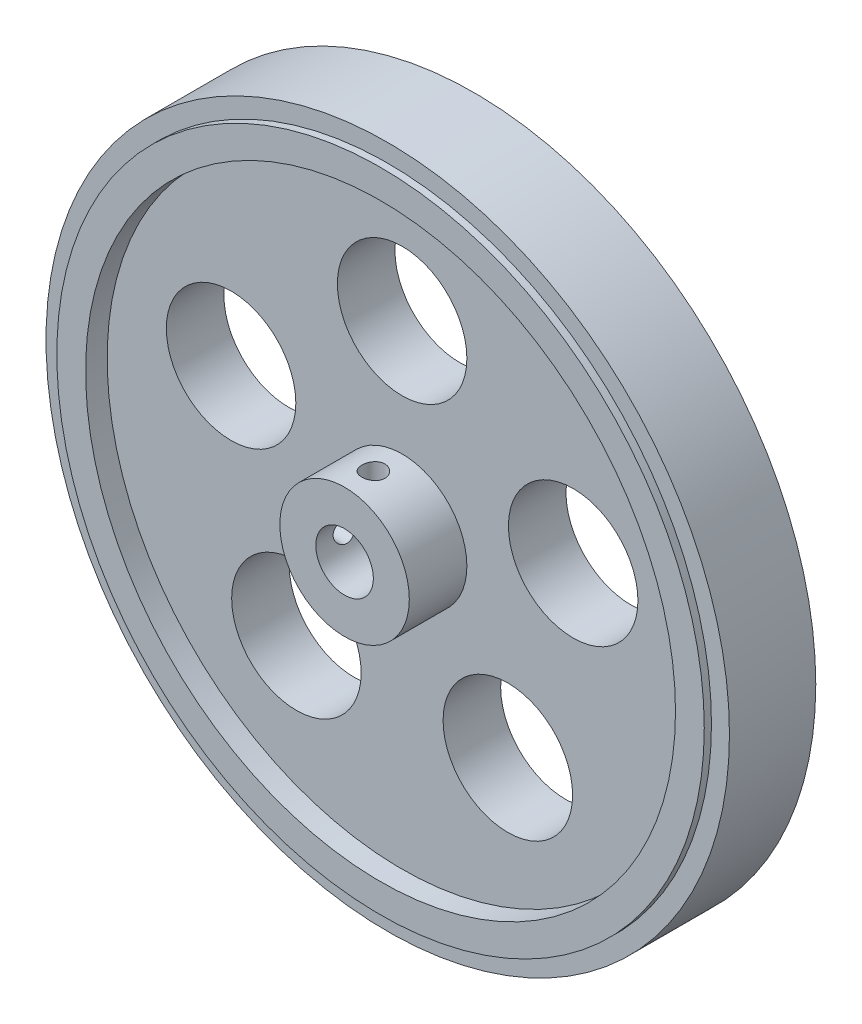
ISO-10303-21;
HEADER;
FILE_DESCRIPTION(('STEP AP214'),'2;1');
FILE_NAME('part.step','',(''),(''),'','','');
FILE_SCHEMA(('AUTOMOTIVE_DESIGN { 1 0 10303 214 1 1 1 1 }'));
ENDSEC;
DATA;
#1=APPLICATION_CONTEXT('core data for automotive mechanical design processes');
#2=APPLICATION_PROTOCOL_DEFINITION('international standard','automotive_design',2000,#1);
#3=PRODUCT_CONTEXT('',#1,'mechanical');
#4=PRODUCT('Part','Part','',(#3));
#5=PRODUCT_RELATED_PRODUCT_CATEGORY('part','',(#4));
#6=PRODUCT_DEFINITION_FORMATION('','',#4);
#7=PRODUCT_DEFINITION_CONTEXT('part definition',#1,'design');
#8=PRODUCT_DEFINITION('design','',#6,#7);
#9=PRODUCT_DEFINITION_SHAPE('','',#8);
#10=(LENGTH_UNIT() NAMED_UNIT(*) SI_UNIT(.MILLI.,.METRE.));
#11=(NAMED_UNIT(*) PLANE_ANGLE_UNIT() SI_UNIT($,.RADIAN.));
#12=(NAMED_UNIT(*) SI_UNIT($,.STERADIAN.) SOLID_ANGLE_UNIT());
#13=UNCERTAINTY_MEASURE_WITH_UNIT(LENGTH_MEASURE(1.E-05),#10,'distance_accuracy_value','');
#14=(GEOMETRIC_REPRESENTATION_CONTEXT(3) GLOBAL_UNCERTAINTY_ASSIGNED_CONTEXT((#13)) GLOBAL_UNIT_ASSIGNED_CONTEXT((#10,
#11,#12)) REPRESENTATION_CONTEXT('',''));
#15=CARTESIAN_POINT('',(0.,0.,0.));
#16=DIRECTION('',(0.,0.,1.));
#17=DIRECTION('',(1.,0.,0.));
#18=AXIS2_PLACEMENT_3D('',#15,#16,#17);
#19=CARTESIAN_POINT('',(0.,0.,-6.));
#20=DIRECTION('',(0.,0.,1.));
#21=DIRECTION('',(1.,0.,0.));
#22=AXIS2_PLACEMENT_3D('',#19,#20,#21);
#23=CYLINDRICAL_SURFACE('',#22,47.5);
#24=CARTESIAN_POINT('',(0.,0.,-6.));
#25=DIRECTION('',(0.,0.,1.));
#26=DIRECTION('',(1.,0.,0.));
#27=AXIS2_PLACEMENT_3D('',#24,#25,#26);
#28=CIRCLE('',#27,47.5);
#29=CARTESIAN_POINT('',(47.5,0.,-6.));
#30=VERTEX_POINT('',#29);
#31=EDGE_CURVE('E42',#30,#30,#28,.T.);
#32=ORIENTED_EDGE('',*,*,#31,.T.);
#33=EDGE_LOOP('',(#32));
#34=FACE_BOUND('',#33,.T.);
#35=CARTESIAN_POINT('',(0.,0.,6.));
#36=DIRECTION('',(0.,0.,1.));
#37=DIRECTION('',(1.,0.,0.));
#38=AXIS2_PLACEMENT_3D('',#35,#36,#37);
#39=CIRCLE('',#38,47.5);
#40=CARTESIAN_POINT('',(47.5,0.,6.));
#41=VERTEX_POINT('',#40);
#42=EDGE_CURVE('E61',#41,#41,#39,.T.);
#43=ORIENTED_EDGE('',*,*,#42,.F.);
#44=EDGE_LOOP('',(#43));
#45=FACE_BOUND('',#44,.T.);
#46=ADVANCED_FACE('F39',(#34,#45),#23,.T.);
#47=CARTESIAN_POINT('',(0.,0.,-6.));
#48=DIRECTION('',(0.,0.,1.));
#49=DIRECTION('',(1.,0.,0.));
#50=AXIS2_PLACEMENT_3D('',#47,#48,#49);
#51=PLANE('',#50);
#52=CARTESIAN_POINT('',(0.,0.,-6.));
#53=DIRECTION('',(0.,0.,-1.));
#54=DIRECTION('',(-1.,0.,0.));
#55=AXIS2_PLACEMENT_3D('',#52,#53,#54);
#56=CIRCLE('',#55,45.);
#57=CARTESIAN_POINT('',(-45.,0.,-6.));
#58=VERTEX_POINT('',#57);
#59=EDGE_CURVE('E10',#58,#58,#56,.T.);
#60=ORIENTED_EDGE('',*,*,#59,.F.);
#61=EDGE_LOOP('',(#60));
#62=FACE_BOUND('',#61,.T.);
#63=ORIENTED_EDGE('',*,*,#31,.F.);
#64=EDGE_LOOP('',(#63));
#65=FACE_BOUND('',#64,.T.);
#66=ADVANCED_FACE('F72',(#62,#65),#51,.F.);
#67=CARTESIAN_POINT('',(0.,0.,6.));
#68=DIRECTION('',(0.,0.,1.));
#69=DIRECTION('',(1.,0.,0.));
#70=AXIS2_PLACEMENT_3D('',#67,#68,#69);
#71=PLANE('',#70);
#72=CARTESIAN_POINT('',(0.,0.,6.));
#73=DIRECTION('',(0.,0.,1.));
#74=DIRECTION('',(1.,0.,0.));
#75=AXIS2_PLACEMENT_3D('',#72,#73,#74);
#76=CIRCLE('',#75,45.);
#77=CARTESIAN_POINT('',(45.,0.,6.));
#78=VERTEX_POINT('',#77);
#79=EDGE_CURVE('E47',#78,#78,#76,.T.);
#80=ORIENTED_EDGE('',*,*,#79,.F.);
#81=EDGE_LOOP('',(#80));
#82=FACE_BOUND('',#81,.T.);
#83=ORIENTED_EDGE('',*,*,#42,.T.);
#84=EDGE_LOOP('',(#83));
#85=FACE_BOUND('',#84,.T.);
#86=ADVANCED_FACE('F74',(#82,#85),#71,.T.);
#87=CARTESIAN_POINT('',(0.,0.,7.));
#88=DIRECTION('',(0.,0.,-1.));
#89=DIRECTION('',(-1.,0.,0.));
#90=AXIS2_PLACEMENT_3D('',#87,#88,#89);
#91=CYLINDRICAL_SURFACE('',#90,45.);
#92=CARTESIAN_POINT('',(0.,0.,7.));
#93=DIRECTION('',(0.,0.,1.));
#94=DIRECTION('',(1.,0.,0.));
#95=AXIS2_PLACEMENT_3D('',#92,#93,#94);
#96=CIRCLE('',#95,45.);
#97=CARTESIAN_POINT('',(45.,0.,7.));
#98=VERTEX_POINT('',#97);
#99=EDGE_CURVE('E58',#98,#98,#96,.T.);
#100=ORIENTED_EDGE('',*,*,#99,.F.);
#101=EDGE_LOOP('',(#100));
#102=FACE_BOUND('',#101,.T.);
#103=ORIENTED_EDGE('',*,*,#79,.T.);
#104=EDGE_LOOP('',(#103));
#105=FACE_BOUND('',#104,.T.);
#106=ADVANCED_FACE('F80',(#102,#105),#91,.T.);
#107=CARTESIAN_POINT('',(0.,0.,7.));
#108=DIRECTION('',(0.,0.,1.));
#109=DIRECTION('',(1.,0.,0.));
#110=AXIS2_PLACEMENT_3D('',#107,#108,#109);
#111=PLANE('',#110);
#112=CARTESIAN_POINT('',(0.,0.,7.));
#113=DIRECTION('',(0.,0.,1.));
#114=DIRECTION('',(1.,0.,0.));
#115=AXIS2_PLACEMENT_3D('',#112,#113,#114);
#116=CIRCLE('',#115,41.);
#117=CARTESIAN_POINT('',(41.,0.,7.));
#118=VERTEX_POINT('',#117);
#119=EDGE_CURVE('E217',#118,#118,#116,.T.);
#120=ORIENTED_EDGE('',*,*,#119,.F.);
#121=EDGE_LOOP('',(#120));
#122=FACE_BOUND('',#121,.T.);
#123=ORIENTED_EDGE('',*,*,#99,.T.);
#124=EDGE_LOOP('',(#123));
#125=FACE_BOUND('',#124,.T.);
#126=ADVANCED_FACE('F86',(#122,#125),#111,.T.);
#127=CARTESIAN_POINT('',(0.,0.,-7.));
#128=DIRECTION('',(0.,0.,1.));
#129=DIRECTION('',(1.,0.,0.));
#130=AXIS2_PLACEMENT_3D('',#127,#128,#129);
#131=CYLINDRICAL_SURFACE('',#130,45.);
#132=CARTESIAN_POINT('',(0.,0.,-7.));
#133=DIRECTION('',(0.,0.,-1.));
#134=DIRECTION('',(-1.,0.,0.));
#135=AXIS2_PLACEMENT_3D('',#132,#133,#134);
#136=CIRCLE('',#135,45.);
#137=CARTESIAN_POINT('',(-45.,0.,-7.));
#138=VERTEX_POINT('',#137);
#139=EDGE_CURVE('E56',#138,#138,#136,.T.);
#140=ORIENTED_EDGE('',*,*,#139,.F.);
#141=EDGE_LOOP('',(#140));
#142=FACE_BOUND('',#141,.T.);
#143=ORIENTED_EDGE('',*,*,#59,.T.);
#144=EDGE_LOOP('',(#143));
#145=FACE_BOUND('',#144,.T.);
#146=ADVANCED_FACE('F90',(#142,#145),#131,.T.);
#147=CARTESIAN_POINT('',(0.,0.,-7.));
#148=DIRECTION('',(0.,0.,-1.));
#149=DIRECTION('',(-1.,0.,0.));
#150=AXIS2_PLACEMENT_3D('',#147,#148,#149);
#151=PLANE('',#150);
#152=CARTESIAN_POINT('',(0.,0.,-7.));
#153=DIRECTION('',(0.,0.,-1.));
#154=DIRECTION('',(-1.,0.,0.));
#155=AXIS2_PLACEMENT_3D('',#152,#153,#154);
#156=CIRCLE('',#155,41.);
#157=CARTESIAN_POINT('',(-41.,0.,-7.));
#158=VERTEX_POINT('',#157);
#159=EDGE_CURVE('E226',#158,#158,#156,.T.);
#160=ORIENTED_EDGE('',*,*,#159,.F.);
#161=EDGE_LOOP('',(#160));
#162=FACE_BOUND('',#161,.T.);
#163=ORIENTED_EDGE('',*,*,#139,.T.);
#164=EDGE_LOOP('',(#163));
#165=FACE_BOUND('',#164,.T.);
#166=ADVANCED_FACE('F94',(#162,#165),#151,.T.);
#167=CARTESIAN_POINT('',(0.,0.,4.));
#168=DIRECTION('',(0.,0.,1.));
#169=DIRECTION('',(1.,0.,0.));
#170=AXIS2_PLACEMENT_3D('',#167,#168,#169);
#171=CYLINDRICAL_SURFACE('',#170,41.);
#172=CARTESIAN_POINT('',(0.,0.,4.));
#173=DIRECTION('',(0.,0.,1.));
#174=DIRECTION('',(1.,0.,0.));
#175=AXIS2_PLACEMENT_3D('',#172,#173,#174);
#176=CIRCLE('',#175,41.);
#177=CARTESIAN_POINT('',(41.,0.,4.));
#178=VERTEX_POINT('',#177);
#179=EDGE_CURVE('E223',#178,#178,#176,.T.);
#180=ORIENTED_EDGE('',*,*,#179,.F.);
#181=EDGE_LOOP('',(#180));
#182=FACE_BOUND('',#181,.T.);
#183=ORIENTED_EDGE('',*,*,#119,.T.);
#184=EDGE_LOOP('',(#183));
#185=FACE_BOUND('',#184,.T.);
#186=ADVANCED_FACE('F98',(#182,#185),#171,.F.);
#187=CARTESIAN_POINT('',(0.,0.,4.));
#188=DIRECTION('',(0.,0.,1.));
#189=DIRECTION('',(1.,0.,0.));
#190=AXIS2_PLACEMENT_3D('',#187,#188,#189);
#191=PLANE('',#190);
#192=CARTESIAN_POINT('',(23.7764129073788,7.72542485937368,4.));
#193=DIRECTION('',(0.,0.,1.));
#194=DIRECTION('',(1.,0.,0.));
#195=AXIS2_PLACEMENT_3D('',#192,#193,#194);
#196=CIRCLE('',#195,9.00000000000004);
#197=CARTESIAN_POINT('',(32.7764129073789,7.72542485937368,4.));
#198=VERTEX_POINT('',#197);
#199=EDGE_CURVE('E249',#198,#198,#196,.T.);
#200=ORIENTED_EDGE('',*,*,#199,.F.);
#201=EDGE_LOOP('',(#200));
#202=FACE_BOUND('',#201,.T.);
#203=CARTESIAN_POINT('',(14.6946313073118,-20.2254248593737,4.));
#204=DIRECTION('',(0.,0.,1.));
#205=DIRECTION('',(1.,0.,0.));
#206=AXIS2_PLACEMENT_3D('',#203,#204,#205);
#207=CIRCLE('',#206,9.00000000000009);
#208=CARTESIAN_POINT('',(23.6946313073119,-20.2254248593737,4.));
#209=VERTEX_POINT('',#208);
#210=EDGE_CURVE('E255',#209,#209,#207,.T.);
#211=ORIENTED_EDGE('',*,*,#210,.F.);
#212=EDGE_LOOP('',(#211));
#213=FACE_BOUND('',#212,.T.);
#214=CARTESIAN_POINT('',(-14.6946313073118,-20.2254248593737,4.));
#215=DIRECTION('',(0.,0.,1.));
#216=DIRECTION('',(1.,0.,0.));
#217=AXIS2_PLACEMENT_3D('',#214,#215,#216);
#218=CIRCLE('',#217,9.00000000000008);
#219=CARTESIAN_POINT('',(-5.69463130731175,-20.2254248593737,4.));
#220=VERTEX_POINT('',#219);
#221=EDGE_CURVE('E261',#220,#220,#218,.T.);
#222=ORIENTED_EDGE('',*,*,#221,.F.);
#223=EDGE_LOOP('',(#222));
#224=FACE_BOUND('',#223,.T.);
#225=CARTESIAN_POINT('',(-23.7764129073788,7.72542485937369,4.));
#226=DIRECTION('',(0.,0.,1.));
#227=DIRECTION('',(1.,0.,0.));
#228=AXIS2_PLACEMENT_3D('',#225,#226,#227);
#229=CIRCLE('',#228,9.00000000000001);
#230=CARTESIAN_POINT('',(-14.7764129073788,7.72542485937369,4.));
#231=VERTEX_POINT('',#230);
#232=EDGE_CURVE('E265',#231,#231,#229,.T.);
#233=ORIENTED_EDGE('',*,*,#232,.F.);
#234=EDGE_LOOP('',(#233));
#235=FACE_BOUND('',#234,.T.);
#236=CARTESIAN_POINT('',(0.,25.,4.));
#237=DIRECTION('',(0.,0.,1.));
#238=DIRECTION('',(1.,0.,0.));
#239=AXIS2_PLACEMENT_3D('',#236,#237,#238);
#240=CIRCLE('',#239,8.99999999999998);
#241=CARTESIAN_POINT('',(8.99999999999998,25.,4.));
#242=VERTEX_POINT('',#241);
#243=EDGE_CURVE('E269',#242,#242,#240,.T.);
#244=ORIENTED_EDGE('',*,*,#243,.F.);
#245=EDGE_LOOP('',(#244));
#246=FACE_BOUND('',#245,.T.);
#247=CARTESIAN_POINT('',(0.,0.,4.));
#248=DIRECTION('',(0.,0.,1.));
#249=DIRECTION('',(1.,0.,0.));
#250=AXIS2_PLACEMENT_3D('',#247,#248,#249);
#251=CIRCLE('',#250,9.);
#252=CARTESIAN_POINT('',(9.,0.,4.));
#253=VERTEX_POINT('',#252);
#254=EDGE_CURVE('E214',#253,#253,#251,.T.);
#255=ORIENTED_EDGE('',*,*,#254,.F.);
#256=EDGE_LOOP('',(#255));
#257=FACE_BOUND('',#256,.T.);
#258=ORIENTED_EDGE('',*,*,#179,.T.);
#259=EDGE_LOOP('',(#258));
#260=FACE_BOUND('',#259,.T.);
#261=ADVANCED_FACE('F118',(#202,#213,#224,#235,#246,#257,#260),#191,.T.);
#262=CARTESIAN_POINT('',(0.,0.,12.));
#263=DIRECTION('',(0.,0.,1.));
#264=DIRECTION('',(1.,0.,0.));
#265=AXIS2_PLACEMENT_3D('',#262,#263,#264);
#266=PLANE('',#265);
#267=CARTESIAN_POINT('',(0.,0.,12.));
#268=DIRECTION('',(0.,0.,1.));
#269=DIRECTION('',(1.,0.,0.));
#270=AXIS2_PLACEMENT_3D('',#267,#268,#269);
#271=CIRCLE('',#270,4.);
#272=CARTESIAN_POINT('',(4.,0.,12.));
#273=VERTEX_POINT('',#272);
#274=EDGE_CURVE('E294',#273,#273,#271,.T.);
#275=ORIENTED_EDGE('',*,*,#274,.F.);
#276=EDGE_LOOP('',(#275));
#277=FACE_BOUND('',#276,.T.);
#278=CARTESIAN_POINT('',(0.,0.,12.));
#279=DIRECTION('',(0.,0.,1.));
#280=DIRECTION('',(1.,0.,0.));
#281=AXIS2_PLACEMENT_3D('',#278,#279,#280);
#282=CIRCLE('',#281,9.);
#283=CARTESIAN_POINT('',(9.,0.,12.));
#284=VERTEX_POINT('',#283);
#285=EDGE_CURVE('E211',#284,#284,#282,.T.);
#286=ORIENTED_EDGE('',*,*,#285,.T.);
#287=EDGE_LOOP('',(#286));
#288=FACE_BOUND('',#287,.T.);
#289=ADVANCED_FACE('F114',(#277,#288),#266,.T.);
#290=CARTESIAN_POINT('',(0.,0.,12.));
#291=DIRECTION('',(0.,0.,-1.));
#292=DIRECTION('',(-1.,0.,0.));
#293=AXIS2_PLACEMENT_3D('',#290,#291,#292);
#294=CYLINDRICAL_SURFACE('',#293,9.);
#295=CARTESIAN_POINT('',(0.,9.,9.6));
#296=CARTESIAN_POINT('',(0.0891199889022123,8.99999842101241,9.59999650999753));
#297=CARTESIAN_POINT('',(0.178286373811932,8.99866254538546,9.59252886703613));
#298=CARTESIAN_POINT('',(0.354112162977067,8.99346217162353,9.56287155401015));
#299=CARTESIAN_POINT('',(0.440769290112072,8.98959544750788,9.540668923705));
#300=CARTESIAN_POINT('',(0.609007816682141,8.97976647847911,9.48223829206875));
#301=CARTESIAN_POINT('',(0.690593523221338,8.97380604116375,9.44602238630523));
#302=CARTESIAN_POINT('',(0.846521639833109,8.9604426739079,9.36062632259557));
#303=CARTESIAN_POINT('',(0.920864750907525,8.95303988377943,9.31144742103254));
#304=CARTESIAN_POINT('',(1.06101042913895,8.93752107386243,9.20095610959205));
#305=CARTESIAN_POINT('',(1.12672329975455,8.92939884036114,9.13953079061428));
#306=CARTESIAN_POINT('',(1.24696773358254,8.91340337467269,9.0065332527793));
#307=CARTESIAN_POINT('',(1.30149854179097,8.90553015932936,8.9349603493167));
#308=CARTESIAN_POINT('',(1.39819750156619,8.89086390002565,8.78307389304275));
#309=CARTESIAN_POINT('',(1.44027562556876,8.88407887715324,8.7027021815132));
#310=CARTESIAN_POINT('',(1.51029875147196,8.87244417371761,8.53589010241383));
#311=CARTESIAN_POINT('',(1.53824484413461,8.86759434379518,8.44945020379562));
#312=CARTESIAN_POINT('',(1.57892525274373,8.86044137771626,8.27391103529108));
#313=CARTESIAN_POINT('',(1.59181525903408,8.85811219515826,8.18484892785442));
#314=CARTESIAN_POINT('',(1.60250059457246,8.85618559649113,8.0057979383732));
#315=CARTESIAN_POINT('',(1.60029713955403,8.85658796036402,7.91580913155451));
#316=CARTESIAN_POINT('',(1.5809846181553,8.86005524545088,7.73857914392946));
#317=CARTESIAN_POINT('',(1.56405155315557,8.86308872669843,7.65131807918593));
#318=CARTESIAN_POINT('',(1.51603718898619,8.87142714923806,7.48089546055713));
#319=CARTESIAN_POINT('',(1.48495534402251,8.87673217815541,7.39773406495518));
#320=CARTESIAN_POINT('',(1.40935057289568,8.88904934759434,7.23735073761909));
#321=CARTESIAN_POINT('',(1.36475561236361,8.89607059700136,7.1601634912911));
#322=CARTESIAN_POINT('',(1.26344153576323,8.91102292647752,7.01430103908486));
#323=CARTESIAN_POINT('',(1.2067213099282,8.91895408979587,6.94562661325334));
#324=CARTESIAN_POINT('',(1.08181303730033,8.93497015847767,6.81772140413576));
#325=CARTESIAN_POINT('',(1.01347422269308,8.94305565233282,6.75863783095746));
#326=CARTESIAN_POINT('',(0.867775747328104,8.95836603849457,6.65275278362007));
#327=CARTESIAN_POINT('',(0.790416012610209,8.96559092374428,6.60595141016978));
#328=CARTESIAN_POINT('',(0.628725387252163,8.97837847205809,6.52594160196901));
#329=CARTESIAN_POINT('',(0.544387323694019,8.9839393969741,6.4927473677391));
#330=CARTESIAN_POINT('',(0.371211899336645,8.99275880001199,6.44103703919972));
#331=CARTESIAN_POINT('',(0.28237496838026,8.9960174976563,6.42251954541019));
#332=CARTESIAN_POINT('',(0.103991168574758,8.99983543164877,6.40089067226623));
#333=CARTESIAN_POINT('',(0.014469509682857,9.00043003979579,6.39757740804007));
#334=CARTESIAN_POINT('',(-0.163849121698735,8.99895010874175,6.40591109791396));
#335=CARTESIAN_POINT('',(-0.252646125889518,8.9968756869381,6.41755739401701));
#336=CARTESIAN_POINT('',(-0.426362531500534,8.99031274069892,6.45531171482474));
#337=CARTESIAN_POINT('',(-0.511304597461475,8.98584109846802,6.48131864407655));
#338=CARTESIAN_POINT('',(-0.675623007789177,8.97498301575709,6.54694737387567));
#339=CARTESIAN_POINT('',(-0.754999004457336,8.96859645578812,6.5865700240528));
#340=CARTESIAN_POINT('',(-0.90680107105383,8.95452886378439,6.67875974307018));
#341=CARTESIAN_POINT('',(-0.97915026454899,8.94683560234911,6.73145149546752));
#342=CARTESIAN_POINT('',(-1.11405184565034,8.93104192631922,6.84811364152417));
#343=CARTESIAN_POINT('',(-1.17660341600601,8.9229414778342,6.9120849751037));
#344=CARTESIAN_POINT('',(-1.29089228646818,8.9071304689102,7.05040034951394));
#345=CARTESIAN_POINT('',(-1.34249245590756,8.89942567549632,7.12485846643002));
#346=CARTESIAN_POINT('',(-1.4324527450687,8.88539029596841,7.28150445705407));
#347=CARTESIAN_POINT('',(-1.47081332418193,8.87905966217619,7.36369206243588));
#348=CARTESIAN_POINT('',(-1.53300592917691,8.8685336915973,7.53309895021014));
#349=CARTESIAN_POINT('',(-1.55690340007955,8.86432875059592,7.6202935822484));
#350=CARTESIAN_POINT('',(-1.5896953542958,8.85850726118019,7.79754125276742));
#351=CARTESIAN_POINT('',(-1.59859134138627,8.85689045332734,7.88759400382285));
#352=CARTESIAN_POINT('',(-1.60108148470831,8.85644051064373,8.0666301769728));
#353=CARTESIAN_POINT('',(-1.59489171371261,8.85756806805314,8.15561056775652));
#354=CARTESIAN_POINT('',(-1.56785629660067,8.86239313508238,8.33124158974503));
#355=CARTESIAN_POINT('',(-1.54701071784785,8.86609063288983,8.4178922316563));
#356=CARTESIAN_POINT('',(-1.4913426083545,8.87562318192817,8.58630350608332));
#357=CARTESIAN_POINT('',(-1.45654117989918,8.88145500474261,8.66807130831137));
#358=CARTESIAN_POINT('',(-1.37397214829578,8.89460176575639,8.82464242816941));
#359=CARTESIAN_POINT('',(-1.32620375866526,8.90191679390947,8.89944532298858));
#360=CARTESIAN_POINT('',(-1.21829594749923,8.91732902502244,9.04105014594484));
#361=CARTESIAN_POINT('',(-1.1579984307139,8.92543544320789,9.10773061615621));
#362=CARTESIAN_POINT('',(-1.02707564037896,8.94144596625312,9.23009985331686));
#363=CARTESIAN_POINT('',(-0.956447994090279,8.94935002414111,9.28578608806405));
#364=CARTESIAN_POINT('',(-0.806197276783407,8.96413880199544,9.38499697811787));
#365=CARTESIAN_POINT('',(-0.726506966982223,8.97101489116936,9.42842111602936));
#366=CARTESIAN_POINT('',(-0.560868965742403,8.98288895349221,9.50119715800776));
#367=CARTESIAN_POINT('',(-0.474927416325986,8.98788874118243,9.53056266557114));
#368=CARTESIAN_POINT('',(-0.323910705887374,8.99439282129417,9.5682264303516));
#369=CARTESIAN_POINT('',(-0.259733829734236,8.99648394692915,9.58012177954452));
#370=CARTESIAN_POINT('',(-0.130379566355957,8.9992880992576,9.59600975712086));
#371=CARTESIAN_POINT('',(-0.0652022004121546,9.00000115522305,9.60000255336478));
#372=CARTESIAN_POINT('',(0.,9.,9.6));
#373=B_SPLINE_CURVE_WITH_KNOTS('',3,(#295,#296,#297,#298,#299,#300,#301,#302,#303,#304,#305,
#306,#307,#308,#309,#310,#311,#312,#313,#314,#315,#316,#317,#318,#319,#320,#321,#322,#323,#324,
#325,#326,#327,#328,#329,#330,#331,#332,#333,#334,#335,#336,#337,#338,#339,#340,#341,#342,#343,
#344,#345,#346,#347,#348,#349,#350,#351,#352,#353,#354,#355,#356,#357,#358,#359,#360,#361,#362,
#363,#364,#365,#366,#367,#368,#369,#370,#371,#372),.UNSPECIFIED.,.T.,.F.,(4,2,2,2,2,2,2,2,2,2,2,
2,2,2,2,2,2,2,2,2,2,2,2,2,2,2,2,2,2,2,2,2,2,2,2,2,2,2,4),(0.,0.26712157461523,0.534478409438381,
0.801604987979056,1.06870568592856,1.33839346950073,1.60809945618666,1.87971016674491,
2.15129991019101,2.42005564284313,2.68878972827276,2.95435619462343,3.21993290615981,
3.48695100494025,3.75399355306365,4.02481082247453,4.29563031240196,4.5667317165881,
4.8378072671677,5.10527280313427,5.37272657501887,5.63832110619031,5.90393221364347,
6.17218198568697,6.44045412138395,6.71190959939084,6.98335565740308,7.25356406549827,
7.52374538578562,7.7900797081413,8.05641280633542,8.32234469843295,8.58829272364878,
8.85782605825659,9.12742139978661,9.39916649807141,9.67064811458915,9.86608445414369,
10.0615166423319),.UNSPECIFIED.);
#374=CARTESIAN_POINT('',(0.,9.,9.6));
#375=VERTEX_POINT('',#374);
#376=EDGE_CURVE('E178',#375,#375,#373,.T.);
#377=ORIENTED_EDGE('',*,*,#376,.F.);
#378=EDGE_LOOP('',(#377));
#379=FACE_BOUND('',#378,.T.);
#380=CARTESIAN_POINT('',(-9.,0.,9.6));
#381=CARTESIAN_POINT('',(-8.99999842101241,0.0891199889022124,9.59999650999753));
#382=CARTESIAN_POINT('',(-8.99866254538546,0.178286373811932,9.59252886703613));
#383=CARTESIAN_POINT('',(-8.99346217162353,0.354112162977067,9.56287155401015));
#384=CARTESIAN_POINT('',(-8.98959544750788,0.440769290112072,9.54066892370501));
#385=CARTESIAN_POINT('',(-8.97976647847911,0.609007816682141,9.48223829206875));
#386=CARTESIAN_POINT('',(-8.97380604116375,0.690593523221337,9.44602238630523));
#387=CARTESIAN_POINT('',(-8.9604426739079,0.846521639833109,9.36062632259557));
#388=CARTESIAN_POINT('',(-8.95303988377943,0.920864750907525,9.31144742103254));
#389=CARTESIAN_POINT('',(-8.93752107386243,1.06101042913895,9.20095610959205));
#390=CARTESIAN_POINT('',(-8.92939884036114,1.12672329975455,9.13953079061428));
#391=CARTESIAN_POINT('',(-8.91340337467269,1.24696773358254,9.0065332527793));
#392=CARTESIAN_POINT('',(-8.90553015932936,1.30149854179097,8.9349603493167));
#393=CARTESIAN_POINT('',(-8.89086390002565,1.39819750156619,8.78307389304275));
#394=CARTESIAN_POINT('',(-8.88407887715324,1.44027562556877,8.7027021815132));
#395=CARTESIAN_POINT('',(-8.87244417371761,1.51029875147196,8.53589010241383));
#396=CARTESIAN_POINT('',(-8.86759434379518,1.53824484413461,8.44945020379562));
#397=CARTESIAN_POINT('',(-8.86044137771626,1.57892525274373,8.27391103529108));
#398=CARTESIAN_POINT('',(-8.85811219515826,1.59181525903408,8.18484892785442));
#399=CARTESIAN_POINT('',(-8.85618559649113,1.60250059457246,8.0057979383732));
#400=CARTESIAN_POINT('',(-8.85658796036402,1.60029713955403,7.91580913155451));
#401=CARTESIAN_POINT('',(-8.86005524545088,1.5809846181553,7.73857914392947));
#402=CARTESIAN_POINT('',(-8.86308872669843,1.56405155315557,7.65131807918593));
#403=CARTESIAN_POINT('',(-8.87142714923806,1.51603718898619,7.48089546055713));
#404=CARTESIAN_POINT('',(-8.87673217815541,1.48495534402251,7.39773406495518));
#405=CARTESIAN_POINT('',(-8.88904934759434,1.40935057289568,7.23735073761909));
#406=CARTESIAN_POINT('',(-8.89607059700136,1.36475561236361,7.1601634912911));
#407=CARTESIAN_POINT('',(-8.91102292647752,1.26344153576323,7.01430103908486));
#408=CARTESIAN_POINT('',(-8.91895408979587,1.2067213099282,6.94562661325334));
#409=CARTESIAN_POINT('',(-8.93497015847767,1.08181303730034,6.81772140413576));
#410=CARTESIAN_POINT('',(-8.94305565233282,1.01347422269308,6.75863783095746));
#411=CARTESIAN_POINT('',(-8.95836603849457,0.867775747328105,6.65275278362007));
#412=CARTESIAN_POINT('',(-8.96559092374428,0.79041601261021,6.60595141016978));
#413=CARTESIAN_POINT('',(-8.97837847205809,0.628725387252162,6.52594160196901));
#414=CARTESIAN_POINT('',(-8.9839393969741,0.544387323694019,6.4927473677391));
#415=CARTESIAN_POINT('',(-8.99275880001199,0.371211899336645,6.44103703919972));
#416=CARTESIAN_POINT('',(-8.9960174976563,0.28237496838026,6.42251954541019));
#417=CARTESIAN_POINT('',(-8.99983543164877,0.103991168574758,6.40089067226623));
#418=CARTESIAN_POINT('',(-9.00043003979579,0.0144695096828569,6.39757740804007));
#419=CARTESIAN_POINT('',(-8.99895010874175,-0.163849121698735,6.40591109791396));
#420=CARTESIAN_POINT('',(-8.9968756869381,-0.252646125889518,6.41755739401701));
#421=CARTESIAN_POINT('',(-8.99031274069892,-0.426362531500533,6.45531171482474));
#422=CARTESIAN_POINT('',(-8.98584109846802,-0.511304597461475,6.48131864407655));
#423=CARTESIAN_POINT('',(-8.97498301575709,-0.675623007789176,6.54694737387567));
#424=CARTESIAN_POINT('',(-8.96859645578812,-0.754999004457336,6.5865700240528));
#425=CARTESIAN_POINT('',(-8.95452886378439,-0.906801071053829,6.67875974307018));
#426=CARTESIAN_POINT('',(-8.94683560234911,-0.97915026454899,6.73145149546752));
#427=CARTESIAN_POINT('',(-8.93104192631921,-1.11405184565034,6.84811364152417));
#428=CARTESIAN_POINT('',(-8.9229414778342,-1.17660341600601,6.9120849751037));
#429=CARTESIAN_POINT('',(-8.9071304689102,-1.29089228646818,7.05040034951394));
#430=CARTESIAN_POINT('',(-8.89942567549632,-1.34249245590756,7.12485846643002));
#431=CARTESIAN_POINT('',(-8.88539029596841,-1.4324527450687,7.28150445705406));
#432=CARTESIAN_POINT('',(-8.87905966217619,-1.47081332418193,7.36369206243587));
#433=CARTESIAN_POINT('',(-8.8685336915973,-1.53300592917691,7.53309895021014));
#434=CARTESIAN_POINT('',(-8.86432875059592,-1.55690340007955,7.6202935822484));
#435=CARTESIAN_POINT('',(-8.85850726118019,-1.5896953542958,7.79754125276742));
#436=CARTESIAN_POINT('',(-8.85689045332734,-1.59859134138627,7.88759400382285));
#437=CARTESIAN_POINT('',(-8.85644051064373,-1.60108148470831,8.0666301769728));
#438=CARTESIAN_POINT('',(-8.85756806805314,-1.59489171371261,8.15561056775652));
#439=CARTESIAN_POINT('',(-8.86239313508238,-1.56785629660067,8.33124158974503));
#440=CARTESIAN_POINT('',(-8.86609063288983,-1.54701071784785,8.4178922316563));
#441=CARTESIAN_POINT('',(-8.87562318192817,-1.4913426083545,8.58630350608332));
#442=CARTESIAN_POINT('',(-8.88145500474261,-1.45654117989918,8.66807130831137));
#443=CARTESIAN_POINT('',(-8.89460176575639,-1.37397214829578,8.82464242816941));
#444=CARTESIAN_POINT('',(-8.90191679390947,-1.32620375866526,8.89944532298858));
#445=CARTESIAN_POINT('',(-8.91732902502243,-1.21829594749924,9.04105014594484));
#446=CARTESIAN_POINT('',(-8.92543544320789,-1.1579984307139,9.1077306161562));
#447=CARTESIAN_POINT('',(-8.94144596625312,-1.02707564037896,9.23009985331686));
#448=CARTESIAN_POINT('',(-8.94935002414111,-0.956447994090281,9.28578608806405));
#449=CARTESIAN_POINT('',(-8.96413880199544,-0.806197276783408,9.38499697811787));
#450=CARTESIAN_POINT('',(-8.97101489116936,-0.726506966982224,9.42842111602936));
#451=CARTESIAN_POINT('',(-8.98288895349221,-0.560868965742404,9.50119715800776));
#452=CARTESIAN_POINT('',(-8.98788874118243,-0.474927416325987,9.53056266557114));
#453=CARTESIAN_POINT('',(-8.99439282129417,-0.323910705887375,9.5682264303516));
#454=CARTESIAN_POINT('',(-8.99648394692915,-0.259733829734237,9.58012177954452));
#455=CARTESIAN_POINT('',(-8.9992880992576,-0.130379566355957,9.59600975712086));
#456=CARTESIAN_POINT('',(-9.00000115522305,-0.0652022004121551,9.60000255336478));
#457=CARTESIAN_POINT('',(-9.,0.,9.6));
#458=B_SPLINE_CURVE_WITH_KNOTS('',3,(#380,#381,#382,#383,#384,#385,#386,#387,#388,#389,#390,
#391,#392,#393,#394,#395,#396,#397,#398,#399,#400,#401,#402,#403,#404,#405,#406,#407,#408,#409,
#410,#411,#412,#413,#414,#415,#416,#417,#418,#419,#420,#421,#422,#423,#424,#425,#426,#427,#428,
#429,#430,#431,#432,#433,#434,#435,#436,#437,#438,#439,#440,#441,#442,#443,#444,#445,#446,#447,
#448,#449,#450,#451,#452,#453,#454,#455,#456,#457),.UNSPECIFIED.,.T.,.F.,(4,2,2,2,2,2,2,2,2,2,2,
2,2,2,2,2,2,2,2,2,2,2,2,2,2,2,2,2,2,2,2,2,2,2,2,2,2,2,4),(0.,0.267121574615231,
0.534478409438381,0.801604987979056,1.06870568592856,1.33839346950073,1.60809945618666,
1.87971016674491,2.15129991019101,2.42005564284313,2.68878972827276,2.95435619462343,
3.21993290615981,3.48695100494025,3.75399355306365,4.02481082247453,4.29563031240196,
4.5667317165881,4.8378072671677,5.10527280313427,5.37272657501887,5.63832110619031,
5.90393221364347,6.17218198568697,6.44045412138396,6.71190959939084,6.98335565740308,
7.25356406549827,7.52374538578563,7.7900797081413,8.05641280633543,8.32234469843295,
8.58829272364878,8.85782605825659,9.12742139978661,9.39916649807141,9.67064811458915,
9.86608445414369,10.0615166423319),.UNSPECIFIED.);
#459=CARTESIAN_POINT('',(-9.,0.,9.6));
#460=VERTEX_POINT('',#459);
#461=EDGE_CURVE('E165',#460,#460,#458,.T.);
#462=ORIENTED_EDGE('',*,*,#461,.F.);
#463=EDGE_LOOP('',(#462));
#464=FACE_BOUND('',#463,.T.);
#465=ORIENTED_EDGE('',*,*,#285,.F.);
#466=EDGE_LOOP('',(#465));
#467=FACE_BOUND('',#466,.T.);
#468=ORIENTED_EDGE('',*,*,#254,.T.);
#469=EDGE_LOOP('',(#468));
#470=FACE_BOUND('',#469,.T.);
#471=ADVANCED_FACE('F110',(#379,#464,#467,#470),#294,.T.);
#472=CARTESIAN_POINT('',(0.,0.,-4.));
#473=DIRECTION('',(0.,0.,-1.));
#474=DIRECTION('',(-1.,0.,0.));
#475=AXIS2_PLACEMENT_3D('',#472,#473,#474);
#476=CYLINDRICAL_SURFACE('',#475,41.);
#477=CARTESIAN_POINT('',(0.,0.,-4.));
#478=DIRECTION('',(0.,0.,-1.));
#479=DIRECTION('',(-1.,0.,0.));
#480=AXIS2_PLACEMENT_3D('',#477,#478,#479);
#481=CIRCLE('',#480,41.);
#482=CARTESIAN_POINT('',(-41.,0.,-4.));
#483=VERTEX_POINT('',#482);
#484=EDGE_CURVE('E218',#483,#483,#481,.T.);
#485=ORIENTED_EDGE('',*,*,#484,.F.);
#486=EDGE_LOOP('',(#485));
#487=FACE_BOUND('',#486,.T.);
#488=ORIENTED_EDGE('',*,*,#159,.T.);
#489=EDGE_LOOP('',(#488));
#490=FACE_BOUND('',#489,.T.);
#491=ADVANCED_FACE('F113',(#487,#490),#476,.F.);
#492=CARTESIAN_POINT('',(0.,0.,-4.));
#493=DIRECTION('',(0.,0.,-1.));
#494=DIRECTION('',(-1.,0.,0.));
#495=AXIS2_PLACEMENT_3D('',#492,#493,#494);
#496=PLANE('',#495);
#497=CARTESIAN_POINT('',(23.7764129073788,7.72542485937368,-4.));
#498=DIRECTION('',(0.,0.,-1.));
#499=DIRECTION('',(-1.,0.,0.));
#500=AXIS2_PLACEMENT_3D('',#497,#498,#499);
#501=CIRCLE('',#500,9.00000000000004);
#502=CARTESIAN_POINT('',(14.7764129073788,7.72542485937368,-4.));
#503=VERTEX_POINT('',#502);
#504=EDGE_CURVE('E278',#503,#503,#501,.T.);
#505=ORIENTED_EDGE('',*,*,#504,.F.);
#506=EDGE_LOOP('',(#505));
#507=FACE_BOUND('',#506,.T.);
#508=CARTESIAN_POINT('',(14.6946313073118,-20.2254248593737,-4.));
#509=DIRECTION('',(0.,0.,-1.));
#510=DIRECTION('',(-1.,0.,0.));
#511=AXIS2_PLACEMENT_3D('',#508,#509,#510);
#512=CIRCLE('',#511,9.00000000000009);
#513=CARTESIAN_POINT('',(5.69463130731174,-20.2254248593737,-4.));
#514=VERTEX_POINT('',#513);
#515=EDGE_CURVE('E282',#514,#514,#512,.T.);
#516=ORIENTED_EDGE('',*,*,#515,.F.);
#517=EDGE_LOOP('',(#516));
#518=FACE_BOUND('',#517,.T.);
#519=CARTESIAN_POINT('',(-14.6946313073118,-20.2254248593737,-4.));
#520=DIRECTION('',(0.,0.,-1.));
#521=DIRECTION('',(-1.,0.,0.));
#522=AXIS2_PLACEMENT_3D('',#519,#520,#521);
#523=CIRCLE('',#522,9.00000000000008);
#524=CARTESIAN_POINT('',(-23.6946313073119,-20.2254248593737,-4.));
#525=VERTEX_POINT('',#524);
#526=EDGE_CURVE('E287',#525,#525,#523,.T.);
#527=ORIENTED_EDGE('',*,*,#526,.F.);
#528=EDGE_LOOP('',(#527));
#529=FACE_BOUND('',#528,.T.);
#530=CARTESIAN_POINT('',(-23.7764129073788,7.72542485937369,-4.));
#531=DIRECTION('',(0.,0.,-1.));
#532=DIRECTION('',(-1.,0.,0.));
#533=AXIS2_PLACEMENT_3D('',#530,#531,#532);
#534=CIRCLE('',#533,9.00000000000001);
#535=CARTESIAN_POINT('',(-32.7764129073788,7.72542485937369,-4.));
#536=VERTEX_POINT('',#535);
#537=EDGE_CURVE('E277',#536,#536,#534,.T.);
#538=ORIENTED_EDGE('',*,*,#537,.F.);
#539=EDGE_LOOP('',(#538));
#540=FACE_BOUND('',#539,.T.);
#541=CARTESIAN_POINT('',(0.,25.,-4.));
#542=DIRECTION('',(0.,0.,-1.));
#543=DIRECTION('',(-1.,0.,0.));
#544=AXIS2_PLACEMENT_3D('',#541,#542,#543);
#545=CIRCLE('',#544,8.99999999999998);
#546=CARTESIAN_POINT('',(-8.99999999999998,25.,-4.));
#547=VERTEX_POINT('',#546);
#548=EDGE_CURVE('E273',#547,#547,#545,.T.);
#549=ORIENTED_EDGE('',*,*,#548,.F.);
#550=EDGE_LOOP('',(#549));
#551=FACE_BOUND('',#550,.T.);
#552=CARTESIAN_POINT('',(0.,0.,-4.));
#553=DIRECTION('',(0.,0.,-1.));
#554=DIRECTION('',(-1.,0.,0.));
#555=AXIS2_PLACEMENT_3D('',#552,#553,#554);
#556=CIRCLE('',#555,9.);
#557=CARTESIAN_POINT('',(-9.,0.,-4.));
#558=VERTEX_POINT('',#557);
#559=EDGE_CURVE('E246',#558,#558,#556,.T.);
#560=ORIENTED_EDGE('',*,*,#559,.F.);
#561=EDGE_LOOP('',(#560));
#562=FACE_BOUND('',#561,.T.);
#563=ORIENTED_EDGE('',*,*,#484,.T.);
#564=EDGE_LOOP('',(#563));
#565=FACE_BOUND('',#564,.T.);
#566=ADVANCED_FACE('F108',(#507,#518,#529,#540,#551,#562,#565),#496,.T.);
#567=CARTESIAN_POINT('',(0.,0.,-7.2));
#568=DIRECTION('',(0.,0.,-1.));
#569=DIRECTION('',(-1.,0.,0.));
#570=AXIS2_PLACEMENT_3D('',#567,#568,#569);
#571=PLANE('',#570);
#572=CARTESIAN_POINT('',(0.,0.,-7.2));
#573=DIRECTION('',(0.,0.,1.));
#574=DIRECTION('',(1.,0.,0.));
#575=AXIS2_PLACEMENT_3D('',#572,#573,#574);
#576=CIRCLE('',#575,4.);
#577=CARTESIAN_POINT('',(4.,0.,-7.2));
#578=VERTEX_POINT('',#577);
#579=EDGE_CURVE('E283',#578,#578,#576,.T.);
#580=ORIENTED_EDGE('',*,*,#579,.T.);
#581=EDGE_LOOP('',(#580));
#582=FACE_BOUND('',#581,.T.);
#583=CARTESIAN_POINT('',(0.,0.,-7.2));
#584=DIRECTION('',(0.,0.,-1.));
#585=DIRECTION('',(-1.,0.,0.));
#586=AXIS2_PLACEMENT_3D('',#583,#584,#585);
#587=CIRCLE('',#586,9.);
#588=CARTESIAN_POINT('',(-9.,0.,-7.2));
#589=VERTEX_POINT('',#588);
#590=EDGE_CURVE('E234',#589,#589,#587,.T.);
#591=ORIENTED_EDGE('',*,*,#590,.T.);
#592=EDGE_LOOP('',(#591));
#593=FACE_BOUND('',#592,.T.);
#594=ADVANCED_FACE('F104',(#582,#593),#571,.T.);
#595=CARTESIAN_POINT('',(0.,0.,-7.2));
#596=DIRECTION('',(0.,0.,1.));
#597=DIRECTION('',(1.,0.,0.));
#598=AXIS2_PLACEMENT_3D('',#595,#596,#597);
#599=CYLINDRICAL_SURFACE('',#598,9.);
#600=ORIENTED_EDGE('',*,*,#590,.F.);
#601=EDGE_LOOP('',(#600));
#602=FACE_BOUND('',#601,.T.);
#603=ORIENTED_EDGE('',*,*,#559,.T.);
#604=EDGE_LOOP('',(#603));
#605=FACE_BOUND('',#604,.T.);
#606=ADVANCED_FACE('F100',(#602,#605),#599,.T.);
#607=CARTESIAN_POINT('',(0.,25.,12.));
#608=DIRECTION('',(0.,0.,-1.));
#609=DIRECTION('',(-1.,0.,0.));
#610=AXIS2_PLACEMENT_3D('',#607,#608,#609);
#611=CYLINDRICAL_SURFACE('',#610,8.99999999999998);
#612=ORIENTED_EDGE('',*,*,#243,.T.);
#613=EDGE_LOOP('',(#612));
#614=FACE_BOUND('',#613,.T.);
#615=ORIENTED_EDGE('',*,*,#548,.T.);
#616=EDGE_LOOP('',(#615));
#617=FACE_BOUND('',#616,.T.);
#618=ADVANCED_FACE('F103',(#614,#617),#611,.F.);
#619=CARTESIAN_POINT('',(-23.7764129073788,7.72542485937369,12.));
#620=DIRECTION('',(0.,0.,-1.));
#621=DIRECTION('',(-1.,0.,0.));
#622=AXIS2_PLACEMENT_3D('',#619,#620,#621);
#623=CYLINDRICAL_SURFACE('',#622,9.00000000000001);
#624=ORIENTED_EDGE('',*,*,#232,.T.);
#625=EDGE_LOOP('',(#624));
#626=FACE_BOUND('',#625,.T.);
#627=ORIENTED_EDGE('',*,*,#537,.T.);
#628=EDGE_LOOP('',(#627));
#629=FACE_BOUND('',#628,.T.);
#630=ADVANCED_FACE('F134',(#626,#629),#623,.F.);
#631=CARTESIAN_POINT('',(-14.6946313073118,-20.2254248593737,12.));
#632=DIRECTION('',(0.,0.,-1.));
#633=DIRECTION('',(-1.,0.,0.));
#634=AXIS2_PLACEMENT_3D('',#631,#632,#633);
#635=CYLINDRICAL_SURFACE('',#634,9.00000000000008);
#636=ORIENTED_EDGE('',*,*,#221,.T.);
#637=EDGE_LOOP('',(#636));
#638=FACE_BOUND('',#637,.T.);
#639=ORIENTED_EDGE('',*,*,#526,.T.);
#640=EDGE_LOOP('',(#639));
#641=FACE_BOUND('',#640,.T.);
#642=ADVANCED_FACE('F144',(#638,#641),#635,.F.);
#643=CARTESIAN_POINT('',(14.6946313073118,-20.2254248593737,12.));
#644=DIRECTION('',(0.,0.,-1.));
#645=DIRECTION('',(-1.,0.,0.));
#646=AXIS2_PLACEMENT_3D('',#643,#644,#645);
#647=CYLINDRICAL_SURFACE('',#646,9.00000000000009);
#648=ORIENTED_EDGE('',*,*,#210,.T.);
#649=EDGE_LOOP('',(#648));
#650=FACE_BOUND('',#649,.T.);
#651=ORIENTED_EDGE('',*,*,#515,.T.);
#652=EDGE_LOOP('',(#651));
#653=FACE_BOUND('',#652,.T.);
#654=ADVANCED_FACE('F140',(#650,#653),#647,.F.);
#655=CARTESIAN_POINT('',(23.7764129073788,7.72542485937368,12.));
#656=DIRECTION('',(0.,0.,-1.));
#657=DIRECTION('',(-1.,0.,0.));
#658=AXIS2_PLACEMENT_3D('',#655,#656,#657);
#659=CYLINDRICAL_SURFACE('',#658,9.00000000000004);
#660=ORIENTED_EDGE('',*,*,#199,.T.);
#661=EDGE_LOOP('',(#660));
#662=FACE_BOUND('',#661,.T.);
#663=ORIENTED_EDGE('',*,*,#504,.T.);
#664=EDGE_LOOP('',(#663));
#665=FACE_BOUND('',#664,.T.);
#666=ADVANCED_FACE('F136',(#662,#665),#659,.F.);
#667=CARTESIAN_POINT('',(0.,0.,-7.2));
#668=DIRECTION('',(0.,0.,1.));
#669=DIRECTION('',(1.,0.,0.));
#670=AXIS2_PLACEMENT_3D('',#667,#668,#669);
#671=CYLINDRICAL_SURFACE('',#670,4.);
#672=CARTESIAN_POINT('',(0.,4.,9.6));
#673=CARTESIAN_POINT('',(-0.0859944043543132,3.99999416981668,9.59999211854102));
#674=CARTESIAN_POINT('',(-0.172138051272539,3.99719435445546,9.5930257983293));
#675=CARTESIAN_POINT('',(-0.341997184334317,3.98626762480513,9.56540183718301));
#676=CARTESIAN_POINT('',(-0.425705422048999,3.97812622959102,9.5447069767311));
#677=CARTESIAN_POINT('',(-0.587963138181923,3.95739367370495,9.49049913755294));
#678=CARTESIAN_POINT('',(-0.666528529293568,3.94481709091258,9.45702812302662));
#679=CARTESIAN_POINT('',(-0.816857576262695,3.91645288636862,9.37838466133876));
#680=CARTESIAN_POINT('',(-0.888623581400794,3.90066637966445,9.33321627606486));
#681=CARTESIAN_POINT('',(-1.02680080605631,3.86664708936335,9.23021160115125));
#682=CARTESIAN_POINT('',(-1.09284981804017,3.84833837543352,9.17191467500779));
#683=CARTESIAN_POINT('',(-1.21454000382778,3.81168461524956,9.04527999721858));
#684=CARTESIAN_POINT('',(-1.27017608570683,3.79333955563034,8.97693736223061));
#685=CARTESIAN_POINT('',(-1.3718996538343,3.75778233437709,8.82845754380619));
#686=CARTESIAN_POINT('',(-1.41745198495638,3.74065692771961,8.74793081118144));
#687=CARTESIAN_POINT('',(-1.49420377522972,3.71066917749434,8.57957088126397));
#688=CARTESIAN_POINT('',(-1.52541005142867,3.69780480995341,8.49174117772131));
#689=CARTESIAN_POINT('',(-1.57111905871669,3.67861086128655,8.31543013312632));
#690=CARTESIAN_POINT('',(-1.58631517264452,3.67201136284484,8.22715901153903));
#691=CARTESIAN_POINT('',(-1.60173836931202,3.66531203239315,8.04909200135419));
#692=CARTESIAN_POINT('',(-1.60197281305058,3.66520900418215,7.95929688429999));
#693=CARTESIAN_POINT('',(-1.58799149400364,3.67128400223995,7.78739466283357));
#694=CARTESIAN_POINT('',(-1.57478025144411,3.6770254003076,7.70518742847278));
#695=CARTESIAN_POINT('',(-1.53595750423826,3.69340950086269,7.54427235519463));
#696=CARTESIAN_POINT('',(-1.51034383584371,3.70405305857338,7.46556512951175));
#697=CARTESIAN_POINT('',(-1.44695578604086,3.72927588070824,7.31198573104317));
#698=CARTESIAN_POINT('',(-1.40894388985225,3.7439310342463,7.23722460875625));
#699=CARTESIAN_POINT('',(-1.32200516858577,3.77550493111912,7.09486734691075));
#700=CARTESIAN_POINT('',(-1.27307424408068,3.79242452365479,7.02727391247775));
#701=CARTESIAN_POINT('',(-1.16124047956355,3.82821389393817,6.8956722169584));
#702=CARTESIAN_POINT('',(-1.09754997037651,3.84713331980921,6.83234501644319));
#703=CARTESIAN_POINT('',(-0.960251541944156,3.88367859966626,6.71705241759837));
#704=CARTESIAN_POINT('',(-0.886641652267548,3.9013041955626,6.66508928207177));
#705=CARTESIAN_POINT('',(-0.729662122084675,3.93371745011639,6.57310604206733));
#706=CARTESIAN_POINT('',(-0.646128393077183,3.94844216076332,6.53334217504236));
#707=CARTESIAN_POINT('',(-0.472819012386307,3.97291862663007,6.46866571113755));
#708=CARTESIAN_POINT('',(-0.38304655747974,3.98267290769906,6.44374556995407));
#709=CARTESIAN_POINT('',(-0.205516710086257,3.99564911605528,6.41084136366424));
#710=CARTESIAN_POINT('',(-0.117954635188429,3.99922356666811,6.40194203659715));
#711=CARTESIAN_POINT('',(0.057476247846253,4.00054782808505,6.39862951957711));
#712=CARTESIAN_POINT('',(0.145344970579138,3.99829914865833,6.40421257476199));
#713=CARTESIAN_POINT('',(0.31474619129759,3.98846053651002,6.42903340204159));
#714=CARTESIAN_POINT('',(0.39638599342038,3.98111513076419,6.44764638428078));
#715=CARTESIAN_POINT('',(0.555308342448624,3.962075531244,6.49714856664785));
#716=CARTESIAN_POINT('',(0.632590328179876,3.95038077885224,6.52803934373494));
#717=CARTESIAN_POINT('',(0.783263028653362,3.92333275816649,6.60222795174396));
#718=CARTESIAN_POINT('',(0.856462418204324,3.90787852783843,6.64587637763452));
#719=CARTESIAN_POINT('',(0.994754872997244,3.8749869179642,6.74395225912451));
#720=CARTESIAN_POINT('',(1.0598446726089,3.85754874488216,6.79838403433809));
#721=CARTESIAN_POINT('',(1.18457843442306,3.82116094110489,6.9206960103597));
#722=CARTESIAN_POINT('',(1.24357914704485,3.80218753140042,6.98922683320496));
#723=CARTESIAN_POINT('',(1.34940095793097,3.76593338333706,7.13555206640749));
#724=CARTESIAN_POINT('',(1.39622004907001,3.74865292421209,7.21334800027196));
#725=CARTESIAN_POINT('',(1.4766460015453,3.71771439926167,7.37716935567528));
#726=CARTESIAN_POINT('',(1.51012047562756,3.7040930470783,7.46326719936985));
#727=CARTESIAN_POINT('',(1.56183697576424,3.68258938782345,7.64058692137213));
#728=CARTESIAN_POINT('',(1.58009024421545,3.67470284556799,7.73180496464994));
#729=CARTESIAN_POINT('',(1.59977249382272,3.66617407439941,7.90970232141964));
#730=CARTESIAN_POINT('',(1.60231766584229,3.66505136806537,7.99623587167468));
#731=CARTESIAN_POINT('',(1.59344252742202,3.66891868826478,8.16843588617063));
#732=CARTESIAN_POINT('',(1.58202399033103,3.67390793859835,8.25410245912207));
#733=CARTESIAN_POINT('',(1.54645709292292,3.68901319263216,8.41866575188403));
#734=CARTESIAN_POINT('',(1.52282999485678,3.69891865461959,8.4976962195464));
#735=CARTESIAN_POINT('',(1.46400435879281,3.72259200986157,8.65070290369079));
#736=CARTESIAN_POINT('',(1.42880262511505,3.73636096964805,8.72467771751986));
#737=CARTESIAN_POINT('',(1.34549821020779,3.76718887683593,8.87008769541662));
#738=CARTESIAN_POINT('',(1.29677226812759,3.78439105850594,8.94113493610439));
#739=CARTESIAN_POINT('',(1.1887136954172,3.8197104349779,9.074394653763));
#740=CARTESIAN_POINT('',(1.1293778678545,3.83782790438725,9.13660445770265));
#741=CARTESIAN_POINT('',(0.997204405017972,3.87434853669915,9.25456228261089));
#742=CARTESIAN_POINT('',(0.923740800916912,3.89269406369748,9.30962984551845));
#743=CARTESIAN_POINT('',(0.767920256228624,3.92640325370973,9.40666963409731));
#744=CARTESIAN_POINT('',(0.685559203637791,3.94176552874325,9.44863576972202));
#745=CARTESIAN_POINT('',(0.515790449996163,3.96751771852689,9.51729777215223));
#746=CARTESIAN_POINT('',(0.428505294575757,3.97799490444022,9.54426345884827));
#747=CARTESIAN_POINT('',(0.250301237024976,3.99315444967493,9.58291129676341));
#748=CARTESIAN_POINT('',(0.15939482068713,3.9978551959651,9.59464194939512));
#749=CARTESIAN_POINT('',(0.0455298383127436,3.99980719603309,9.59951630478262));
#750=CARTESIAN_POINT('',(0.0227701509926067,4.00000154375341,9.60000208690336));
#751=CARTESIAN_POINT('',(0.,4.,9.6));
#752=B_SPLINE_CURVE_WITH_KNOTS('',3,(#672,#673,#674,#675,#676,#677,#678,#679,#680,#681,#682,
#683,#684,#685,#686,#687,#688,#689,#690,#691,#692,#693,#694,#695,#696,#697,#698,#699,#700,#701,
#702,#703,#704,#705,#706,#707,#708,#709,#710,#711,#712,#713,#714,#715,#716,#717,#718,#719,#720,
#721,#722,#723,#724,#725,#726,#727,#728,#729,#730,#731,#732,#733,#734,#735,#736,#737,#738,#739,
#740,#741,#742,#743,#744,#745,#746,#747,#748,#749,#750,#751),.UNSPECIFIED.,.T.,.F.,(4,2,2,2,2,2,
2,2,2,2,2,2,2,2,2,2,2,2,2,2,2,2,2,2,2,2,2,2,2,2,2,2,2,2,2,2,2,2,2,4),(0.,0.257922390314457,
0.516546908806348,0.774329165977266,1.03202202854387,1.30077905360318,1.56966715947529,
1.85052207055373,2.13124338494615,2.39923284247063,2.6670904507239,2.91630662721098,
3.16556629804838,3.41991301039053,3.67435537550547,3.94846679349246,4.22263274271786,
4.50221530530245,4.78165564891033,5.04455347622406,5.30738314856066,5.55840364451493,
5.80945639195038,6.0681881071861,6.32702367599176,6.60294779699531,6.87891735234999,
7.15756036112663,7.43599738116748,7.69439738714199,7.95276458050437,8.20091454839016,
8.4491330864413,8.71156374445354,8.97407361078715,9.2536033882707,9.53326290912427,
9.80771440810656,10.0812900192347,10.1495843671744),.UNSPECIFIED.);
#753=CARTESIAN_POINT('',(0.,4.,9.6));
#754=VERTEX_POINT('',#753);
#755=EDGE_CURVE('E192',#754,#754,#752,.T.);
#756=ORIENTED_EDGE('',*,*,#755,.F.);
#757=EDGE_LOOP('',(#756));
#758=FACE_BOUND('',#757,.T.);
#759=CARTESIAN_POINT('',(-4.,0.,9.6));
#760=CARTESIAN_POINT('',(-3.99999416981668,-0.085994404354313,9.59999211854102));
#761=CARTESIAN_POINT('',(-3.99719435445546,-0.172138051272539,9.5930257983293));
#762=CARTESIAN_POINT('',(-3.98626762480513,-0.341997184334317,9.56540183718301));
#763=CARTESIAN_POINT('',(-3.97812622959102,-0.425705422048999,9.5447069767311));
#764=CARTESIAN_POINT('',(-3.95739367370495,-0.587963138181923,9.49049913755294));
#765=CARTESIAN_POINT('',(-3.94481709091258,-0.666528529293568,9.45702812302662));
#766=CARTESIAN_POINT('',(-3.91645288636862,-0.816857576262694,9.37838466133877));
#767=CARTESIAN_POINT('',(-3.90066637966445,-0.888623581400794,9.33321627606486));
#768=CARTESIAN_POINT('',(-3.86664708936335,-1.02680080605631,9.23021160115125));
#769=CARTESIAN_POINT('',(-3.84833837543352,-1.09284981804017,9.17191467500779));
#770=CARTESIAN_POINT('',(-3.81168461524956,-1.21454000382778,9.04527999721858));
#771=CARTESIAN_POINT('',(-3.79333955563034,-1.27017608570683,8.97693736223061));
#772=CARTESIAN_POINT('',(-3.75778233437709,-1.3718996538343,8.82845754380619));
#773=CARTESIAN_POINT('',(-3.74065692771961,-1.41745198495638,8.74793081118144));
#774=CARTESIAN_POINT('',(-3.71066917749434,-1.49420377522972,8.57957088126397));
#775=CARTESIAN_POINT('',(-3.69780480995341,-1.52541005142867,8.49174117772131));
#776=CARTESIAN_POINT('',(-3.67861086128655,-1.5711190587167,8.31543013312632));
#777=CARTESIAN_POINT('',(-3.67201136284484,-1.58631517264452,8.22715901153903));
#778=CARTESIAN_POINT('',(-3.66531203239315,-1.60173836931202,8.04909200135419));
#779=CARTESIAN_POINT('',(-3.66520900418215,-1.60197281305058,7.95929688429999));
#780=CARTESIAN_POINT('',(-3.67128400223995,-1.58799149400364,7.78739466283357));
#781=CARTESIAN_POINT('',(-3.6770254003076,-1.57478025144411,7.70518742847278));
#782=CARTESIAN_POINT('',(-3.69340950086269,-1.53595750423826,7.54427235519463));
#783=CARTESIAN_POINT('',(-3.70405305857338,-1.51034383584371,7.46556512951175));
#784=CARTESIAN_POINT('',(-3.72927588070824,-1.44695578604086,7.31198573104317));
#785=CARTESIAN_POINT('',(-3.7439310342463,-1.40894388985225,7.23722460875625));
#786=CARTESIAN_POINT('',(-3.77550493111912,-1.32200516858577,7.09486734691075));
#787=CARTESIAN_POINT('',(-3.79242452365479,-1.27307424408068,7.02727391247775));
#788=CARTESIAN_POINT('',(-3.82821389393817,-1.16124047956355,6.8956722169584));
#789=CARTESIAN_POINT('',(-3.84713331980921,-1.09754997037651,6.83234501644319));
#790=CARTESIAN_POINT('',(-3.88367859966626,-0.960251541944155,6.71705241759837));
#791=CARTESIAN_POINT('',(-3.9013041955626,-0.886641652267548,6.66508928207176));
#792=CARTESIAN_POINT('',(-3.93371745011639,-0.729662122084675,6.57310604206733));
#793=CARTESIAN_POINT('',(-3.94844216076332,-0.646128393077182,6.53334217504236));
#794=CARTESIAN_POINT('',(-3.97291862663007,-0.472819012386306,6.46866571113755));
#795=CARTESIAN_POINT('',(-3.98267290769906,-0.38304655747974,6.44374556995407));
#796=CARTESIAN_POINT('',(-3.99564911605528,-0.205516710086257,6.41084136366423));
#797=CARTESIAN_POINT('',(-3.99922356666811,-0.117954635188429,6.40194203659715));
#798=CARTESIAN_POINT('',(-4.00054782808505,0.0574762478462531,6.39862951957711));
#799=CARTESIAN_POINT('',(-3.99829914865833,0.145344970579139,6.40421257476199));
#800=CARTESIAN_POINT('',(-3.98846053651002,0.31474619129759,6.42903340204159));
#801=CARTESIAN_POINT('',(-3.98111513076419,0.39638599342038,6.44764638428078));
#802=CARTESIAN_POINT('',(-3.962075531244,0.555308342448624,6.49714856664785));
#803=CARTESIAN_POINT('',(-3.95038077885224,0.632590328179876,6.52803934373494));
#804=CARTESIAN_POINT('',(-3.92333275816649,0.783263028653362,6.60222795174396));
#805=CARTESIAN_POINT('',(-3.90787852783843,0.856462418204325,6.64587637763452));
#806=CARTESIAN_POINT('',(-3.8749869179642,0.994754872997245,6.74395225912451));
#807=CARTESIAN_POINT('',(-3.85754874488216,1.0598446726089,6.79838403433809));
#808=CARTESIAN_POINT('',(-3.82116094110489,1.18457843442306,6.9206960103597));
#809=CARTESIAN_POINT('',(-3.80218753140042,1.24357914704485,6.98922683320496));
#810=CARTESIAN_POINT('',(-3.76593338333706,1.34940095793097,7.13555206640749));
#811=CARTESIAN_POINT('',(-3.74865292421209,1.39622004907001,7.21334800027196));
#812=CARTESIAN_POINT('',(-3.71771439926167,1.4766460015453,7.37716935567528));
#813=CARTESIAN_POINT('',(-3.7040930470783,1.51012047562756,7.46326719936985));
#814=CARTESIAN_POINT('',(-3.68258938782345,1.56183697576424,7.64058692137212));
#815=CARTESIAN_POINT('',(-3.67470284556799,1.58009024421545,7.73180496464994));
#816=CARTESIAN_POINT('',(-3.66617407439941,1.59977249382272,7.90970232141964));
#817=CARTESIAN_POINT('',(-3.66505136806537,1.60231766584229,7.99623587167468));
#818=CARTESIAN_POINT('',(-3.66891868826478,1.59344252742202,8.16843588617063));
#819=CARTESIAN_POINT('',(-3.67390793859835,1.58202399033103,8.25410245912207));
#820=CARTESIAN_POINT('',(-3.68901319263216,1.54645709292292,8.41866575188403));
#821=CARTESIAN_POINT('',(-3.69891865461959,1.52282999485678,8.4976962195464));
#822=CARTESIAN_POINT('',(-3.72259200986157,1.46400435879281,8.65070290369078));
#823=CARTESIAN_POINT('',(-3.73636096964805,1.42880262511505,8.72467771751986));
#824=CARTESIAN_POINT('',(-3.76718887683593,1.34549821020779,8.87008769541662));
#825=CARTESIAN_POINT('',(-3.78439105850593,1.29677226812759,8.94113493610439));
#826=CARTESIAN_POINT('',(-3.8197104349779,1.1887136954172,9.07439465376301));
#827=CARTESIAN_POINT('',(-3.83782790438725,1.1293778678545,9.13660445770265));
#828=CARTESIAN_POINT('',(-3.87434853669915,0.997204405017971,9.25456228261089));
#829=CARTESIAN_POINT('',(-3.89269406369748,0.923740800916911,9.30962984551846));
#830=CARTESIAN_POINT('',(-3.92640325370973,0.767920256228623,9.40666963409731));
#831=CARTESIAN_POINT('',(-3.94176552874325,0.685559203637791,9.44863576972202));
#832=CARTESIAN_POINT('',(-3.96751771852689,0.515790449996164,9.51729777215223));
#833=CARTESIAN_POINT('',(-3.97799490444022,0.428505294575758,9.54426345884827));
#834=CARTESIAN_POINT('',(-3.99315444967493,0.250301237024978,9.58291129676341));
#835=CARTESIAN_POINT('',(-3.9978551959651,0.159394820687131,9.59464194939512));
#836=CARTESIAN_POINT('',(-3.99980719603309,0.0455298383127442,9.59951630478262));
#837=CARTESIAN_POINT('',(-4.00000154375341,0.022770150992607,9.60000208690336));
#838=CARTESIAN_POINT('',(-4.,0.,9.6));
#839=B_SPLINE_CURVE_WITH_KNOTS('',3,(#759,#760,#761,#762,#763,#764,#765,#766,#767,#768,#769,
#770,#771,#772,#773,#774,#775,#776,#777,#778,#779,#780,#781,#782,#783,#784,#785,#786,#787,#788,
#789,#790,#791,#792,#793,#794,#795,#796,#797,#798,#799,#800,#801,#802,#803,#804,#805,#806,#807,
#808,#809,#810,#811,#812,#813,#814,#815,#816,#817,#818,#819,#820,#821,#822,#823,#824,#825,#826,
#827,#828,#829,#830,#831,#832,#833,#834,#835,#836,#837,#838),.UNSPECIFIED.,.T.,.F.,(4,2,2,2,2,2,
2,2,2,2,2,2,2,2,2,2,2,2,2,2,2,2,2,2,2,2,2,2,2,2,2,2,2,2,2,2,2,2,2,4),(0.,0.257922390314457,
0.516546908806348,0.774329165977265,1.03202202854387,1.30077905360318,1.56966715947529,
1.85052207055374,2.13124338494615,2.39923284247063,2.66709045072391,2.91630662721098,
3.16556629804838,3.41991301039053,3.67435537550547,3.94846679349246,4.22263274271787,
4.50221530530245,4.78165564891033,5.04455347622406,5.30738314856066,5.55840364451493,
5.80945639195038,6.06818810718611,6.32702367599176,6.60294779699531,6.87891735234999,
7.15756036112663,7.43599738116748,7.69439738714199,7.95276458050437,8.20091454839016,
8.4491330864413,8.71156374445355,8.97407361078716,9.2536033882707,9.53326290912427,
9.80771440810656,10.0812900192347,10.1495843671744),.UNSPECIFIED.);
#840=CARTESIAN_POINT('',(-4.,0.,9.6));
#841=VERTEX_POINT('',#840);
#842=EDGE_CURVE('E171',#841,#841,#839,.T.);
#843=ORIENTED_EDGE('',*,*,#842,.F.);
#844=EDGE_LOOP('',(#843));
#845=FACE_BOUND('',#844,.T.);
#846=ORIENTED_EDGE('',*,*,#579,.F.);
#847=EDGE_LOOP('',(#846));
#848=FACE_BOUND('',#847,.T.);
#849=ORIENTED_EDGE('',*,*,#274,.T.);
#850=EDGE_LOOP('',(#849));
#851=FACE_BOUND('',#850,.T.);
#852=ADVANCED_FACE('F139',(#758,#845,#848,#851),#671,.F.);
#853=CARTESIAN_POINT('',(47.501,0.,8.));
#854=DIRECTION('',(-1.,0.,0.));
#855=DIRECTION('',(0.,0.,1.));
#856=AXIS2_PLACEMENT_3D('',#853,#854,#855);
#857=CYLINDRICAL_SURFACE('',#856,1.6);
#858=ORIENTED_EDGE('',*,*,#842,.T.);
#859=EDGE_LOOP('',(#858));
#860=FACE_BOUND('',#859,.T.);
#861=ORIENTED_EDGE('',*,*,#461,.T.);
#862=EDGE_LOOP('',(#861));
#863=FACE_BOUND('',#862,.T.);
#864=ADVANCED_FACE('F154',(#860,#863),#857,.F.);
#865=CARTESIAN_POINT('',(0.,-47.501,8.));
#866=DIRECTION('',(0.,1.,0.));
#867=DIRECTION('',(0.,0.,1.));
#868=AXIS2_PLACEMENT_3D('',#865,#866,#867);
#869=CYLINDRICAL_SURFACE('',#868,1.6);
#870=ORIENTED_EDGE('',*,*,#755,.T.);
#871=EDGE_LOOP('',(#870));
#872=FACE_BOUND('',#871,.T.);
#873=ORIENTED_EDGE('',*,*,#376,.T.);
#874=EDGE_LOOP('',(#873));
#875=FACE_BOUND('',#874,.T.);
#876=ADVANCED_FACE('F159',(#872,#875),#869,.F.);
#877=CLOSED_SHELL('',(#46,#66,#86,#106,#126,#146,#166,#186,#261,#289,#471,#491,#566,#594,#606,
#618,#630,#642,#654,#666,#852,#864,#876));
#878=MANIFOLD_SOLID_BREP('B2',#877);
#879=ADVANCED_BREP_SHAPE_REPRESENTATION('',(#18,#878),#14);
#880=SHAPE_DEFINITION_REPRESENTATION(#9,#879);
ENDSEC;
END-ISO-10303-21;
